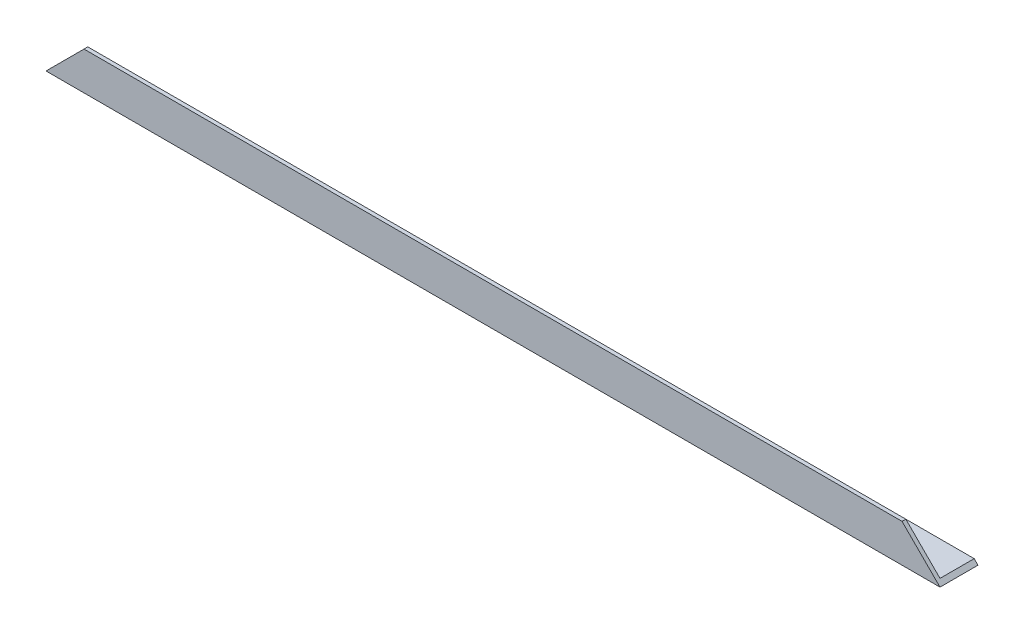
ISO-10303-21;
HEADER;
FILE_DESCRIPTION(('STEP AP214'),'2;1');
FILE_NAME('part.step','',(''),(''),'','','');
FILE_SCHEMA(('AUTOMOTIVE_DESIGN { 1 0 10303 214 1 1 1 1 }'));
ENDSEC;
DATA;
#1=APPLICATION_CONTEXT('core data for automotive mechanical design processes');
#2=APPLICATION_PROTOCOL_DEFINITION('international standard','automotive_design',2000,#1);
#3=PRODUCT_CONTEXT('',#1,'mechanical');
#4=PRODUCT('Part','Part','',(#3));
#5=PRODUCT_RELATED_PRODUCT_CATEGORY('part','',(#4));
#6=PRODUCT_DEFINITION_FORMATION('','',#4);
#7=PRODUCT_DEFINITION_CONTEXT('part definition',#1,'design');
#8=PRODUCT_DEFINITION('design','',#6,#7);
#9=PRODUCT_DEFINITION_SHAPE('','',#8);
#10=(LENGTH_UNIT() NAMED_UNIT(*) SI_UNIT(.MILLI.,.METRE.));
#11=(NAMED_UNIT(*) PLANE_ANGLE_UNIT() SI_UNIT($,.RADIAN.));
#12=(NAMED_UNIT(*) SI_UNIT($,.STERADIAN.) SOLID_ANGLE_UNIT());
#13=UNCERTAINTY_MEASURE_WITH_UNIT(LENGTH_MEASURE(1.E-05),#10,'distance_accuracy_value','');
#14=(GEOMETRIC_REPRESENTATION_CONTEXT(3) GLOBAL_UNCERTAINTY_ASSIGNED_CONTEXT((#13)) GLOBAL_UNIT_ASSIGNED_CONTEXT((#10,
#11,#12)) REPRESENTATION_CONTEXT('',''));
#15=CARTESIAN_POINT('',(0.,0.,0.));
#16=DIRECTION('',(0.,0.,1.));
#17=DIRECTION('',(1.,0.,0.));
#18=AXIS2_PLACEMENT_3D('',#15,#16,#17);
#19=CARTESIAN_POINT('',(353.,1.49999999999998,-15.));
#20=DIRECTION('',(0.,0.,1.));
#21=DIRECTION('',(1.,0.,0.));
#22=AXIS2_PLACEMENT_3D('',#19,#20,#21);
#23=PLANE('',#22);
#24=DIRECTION('',(-0.707106781186546,0.707106781186549,0.));
#25=VECTOR('',#24,1.);
#26=CARTESIAN_POINT('',(353.,0.,-15.));
#27=LINE('',#26,#25);
#28=CARTESIAN_POINT('',(353.,0.,-15.));
#29=VERTEX_POINT('',#28);
#30=CARTESIAN_POINT('',(351.5,1.49999999999998,-15.));
#31=VERTEX_POINT('',#30);
#32=EDGE_CURVE('E86',#29,#31,#27,.T.);
#33=ORIENTED_EDGE('',*,*,#32,.F.);
#34=DIRECTION('',(-1.,0.,0.));
#35=VECTOR('',#34,1.);
#36=CARTESIAN_POINT('',(353.,0.,-15.));
#37=LINE('',#36,#35);
#38=CARTESIAN_POINT('',(0.,0.,-15.));
#39=VERTEX_POINT('',#38);
#40=EDGE_CURVE('E11',#29,#39,#37,.T.);
#41=ORIENTED_EDGE('',*,*,#40,.T.);
#42=DIRECTION('',(0.707106781186546,0.707106781186549,0.));
#43=VECTOR('',#42,1.);
#44=CARTESIAN_POINT('',(0.,0.,-15.));
#45=LINE('',#44,#43);
#46=CARTESIAN_POINT('',(1.49999999999996,1.49999999999998,-15.));
#47=VERTEX_POINT('',#46);
#48=EDGE_CURVE('E122',#39,#47,#45,.T.);
#49=ORIENTED_EDGE('',*,*,#48,.T.);
#50=DIRECTION('',(-1.,0.,0.));
#51=VECTOR('',#50,1.);
#52=CARTESIAN_POINT('',(353.,1.49999999999998,-15.));
#53=LINE('',#52,#51);
#54=EDGE_CURVE('E45',#31,#47,#53,.T.);
#55=ORIENTED_EDGE('',*,*,#54,.F.);
#56=EDGE_LOOP('',(#33,#41,#49,#55));
#57=FACE_BOUND('',#56,.T.);
#58=ADVANCED_FACE('F36',(#57),#23,.F.);
#59=CARTESIAN_POINT('',(353.,1.5,-1.50000000000002));
#60=DIRECTION('',(0.,-1.,0.));
#61=DIRECTION('',(0.,0.,-1.));
#62=AXIS2_PLACEMENT_3D('',#59,#60,#61);
#63=PLANE('',#62);
#64=DIRECTION('',(0.,0.,1.));
#65=VECTOR('',#64,1.);
#66=CARTESIAN_POINT('',(351.5,1.5,-1.50000000000002));
#67=LINE('',#66,#65);
#68=CARTESIAN_POINT('',(351.5,1.5,-1.50000000000002));
#69=VERTEX_POINT('',#68);
#70=EDGE_CURVE('E119',#31,#69,#67,.T.);
#71=ORIENTED_EDGE('',*,*,#70,.F.);
#72=ORIENTED_EDGE('',*,*,#54,.T.);
#73=DIRECTION('',(0.,0.,1.));
#74=VECTOR('',#73,1.);
#75=CARTESIAN_POINT('',(1.5,1.5,-1.49999999999959));
#76=LINE('',#75,#74);
#77=CARTESIAN_POINT('',(1.49999999999997,1.5,-1.50000000000002));
#78=VERTEX_POINT('',#77);
#79=EDGE_CURVE('E103',#47,#78,#76,.T.);
#80=ORIENTED_EDGE('',*,*,#79,.T.);
#81=DIRECTION('',(-1.,0.,0.));
#82=VECTOR('',#81,1.);
#83=CARTESIAN_POINT('',(353.,1.5,-1.50000000000002));
#84=LINE('',#83,#82);
#85=EDGE_CURVE('E114',#69,#78,#84,.T.);
#86=ORIENTED_EDGE('',*,*,#85,.F.);
#87=EDGE_LOOP('',(#71,#72,#80,#86));
#88=FACE_BOUND('',#87,.T.);
#89=ADVANCED_FACE('F117',(#88),#63,.F.);
#90=CARTESIAN_POINT('',(353.,15.,-1.5));
#91=DIRECTION('',(0.,0.,1.));
#92=DIRECTION('',(0.,-1.,0.));
#93=AXIS2_PLACEMENT_3D('',#90,#91,#92);
#94=PLANE('',#93);
#95=DIRECTION('',(-0.707106781186546,0.707106781186549,0.));
#96=VECTOR('',#95,1.);
#97=CARTESIAN_POINT('',(345.5,7.50000000000002,-1.50000000000001));
#98=LINE('',#97,#96);
#99=CARTESIAN_POINT('',(338.,15.,-1.5));
#100=VERTEX_POINT('',#99);
#101=EDGE_CURVE('E138',#69,#100,#98,.T.);
#102=ORIENTED_EDGE('',*,*,#101,.F.);
#103=ORIENTED_EDGE('',*,*,#85,.T.);
#104=DIRECTION('',(0.707106781186546,0.707106781186549,0.));
#105=VECTOR('',#104,1.);
#106=CARTESIAN_POINT('',(183.999999999999,184.,-1.49999999999972));
#107=LINE('',#106,#105);
#108=CARTESIAN_POINT('',(14.9999999999999,15.,-1.5));
#109=VERTEX_POINT('',#108);
#110=EDGE_CURVE('E106',#78,#109,#107,.T.);
#111=ORIENTED_EDGE('',*,*,#110,.T.);
#112=DIRECTION('',(-1.,0.,0.));
#113=VECTOR('',#112,1.);
#114=CARTESIAN_POINT('',(353.,15.,-1.5));
#115=LINE('',#114,#113);
#116=EDGE_CURVE('E112',#100,#109,#115,.T.);
#117=ORIENTED_EDGE('',*,*,#116,.F.);
#118=EDGE_LOOP('',(#102,#103,#111,#117));
#119=FACE_BOUND('',#118,.T.);
#120=ADVANCED_FACE('F137',(#119),#94,.F.);
#121=CARTESIAN_POINT('',(353.,15.,0.));
#122=DIRECTION('',(0.,-1.,0.));
#123=DIRECTION('',(0.,0.,-1.));
#124=AXIS2_PLACEMENT_3D('',#121,#122,#123);
#125=PLANE('',#124);
#126=DIRECTION('',(0.,0.,1.));
#127=VECTOR('',#126,1.);
#128=CARTESIAN_POINT('',(338.,15.,0.));
#129=LINE('',#128,#127);
#130=CARTESIAN_POINT('',(338.,15.,0.));
#131=VERTEX_POINT('',#130);
#132=EDGE_CURVE('E98',#100,#131,#129,.T.);
#133=ORIENTED_EDGE('',*,*,#132,.F.);
#134=ORIENTED_EDGE('',*,*,#116,.T.);
#135=DIRECTION('',(0.,0.,1.));
#136=VECTOR('',#135,1.);
#137=CARTESIAN_POINT('',(14.9999999999999,15.,0.));
#138=LINE('',#137,#136);
#139=CARTESIAN_POINT('',(14.9999999999999,15.,0.));
#140=VERTEX_POINT('',#139);
#141=EDGE_CURVE('E125',#109,#140,#138,.T.);
#142=ORIENTED_EDGE('',*,*,#141,.T.);
#143=DIRECTION('',(-1.,0.,0.));
#144=VECTOR('',#143,1.);
#145=CARTESIAN_POINT('',(353.,15.,0.));
#146=LINE('',#145,#144);
#147=EDGE_CURVE('E110',#131,#140,#146,.T.);
#148=ORIENTED_EDGE('',*,*,#147,.F.);
#149=EDGE_LOOP('',(#133,#134,#142,#148));
#150=FACE_BOUND('',#149,.T.);
#151=ADVANCED_FACE('F146',(#150),#125,.F.);
#152=CARTESIAN_POINT('',(353.,0.,0.));
#153=DIRECTION('',(0.,0.,-1.));
#154=DIRECTION('',(-1.,0.,0.));
#155=AXIS2_PLACEMENT_3D('',#152,#153,#154);
#156=PLANE('',#155);
#157=DIRECTION('',(-0.707106781186546,0.707106781186549,0.));
#158=VECTOR('',#157,1.);
#159=CARTESIAN_POINT('',(353.,0.,0.));
#160=LINE('',#159,#158);
#161=CARTESIAN_POINT('',(353.,0.,0.));
#162=VERTEX_POINT('',#161);
#163=EDGE_CURVE('E51',#162,#131,#160,.T.);
#164=ORIENTED_EDGE('',*,*,#163,.T.);
#165=ORIENTED_EDGE('',*,*,#147,.T.);
#166=DIRECTION('',(0.707106781186546,0.707106781186549,0.));
#167=VECTOR('',#166,1.);
#168=CARTESIAN_POINT('',(0.,0.,0.));
#169=LINE('',#168,#167);
#170=CARTESIAN_POINT('',(0.,0.,0.));
#171=VERTEX_POINT('',#170);
#172=EDGE_CURVE('E126',#171,#140,#169,.T.);
#173=ORIENTED_EDGE('',*,*,#172,.F.);
#174=DIRECTION('',(-1.,0.,0.));
#175=VECTOR('',#174,1.);
#176=CARTESIAN_POINT('',(353.,0.,0.));
#177=LINE('',#176,#175);
#178=EDGE_CURVE('E91',#162,#171,#177,.T.);
#179=ORIENTED_EDGE('',*,*,#178,.F.);
#180=EDGE_LOOP('',(#164,#165,#173,#179));
#181=FACE_BOUND('',#180,.T.);
#182=ADVANCED_FACE('F144',(#181),#156,.F.);
#183=CARTESIAN_POINT('',(353.,0.,-15.));
#184=DIRECTION('',(0.,1.,0.));
#185=DIRECTION('',(0.,0.,1.));
#186=AXIS2_PLACEMENT_3D('',#183,#184,#185);
#187=PLANE('',#186);
#188=DIRECTION('',(0.,0.,-1.));
#189=VECTOR('',#188,1.);
#190=CARTESIAN_POINT('',(0.,0.,-15.));
#191=LINE('',#190,#189);
#192=EDGE_CURVE('E92',#171,#39,#191,.T.);
#193=ORIENTED_EDGE('',*,*,#192,.T.);
#194=ORIENTED_EDGE('',*,*,#40,.F.);
#195=DIRECTION('',(0.,0.,-1.));
#196=VECTOR('',#195,1.);
#197=CARTESIAN_POINT('',(353.,0.,-15.));
#198=LINE('',#197,#196);
#199=EDGE_CURVE('E83',#162,#29,#198,.T.);
#200=ORIENTED_EDGE('',*,*,#199,.F.);
#201=ORIENTED_EDGE('',*,*,#178,.T.);
#202=EDGE_LOOP('',(#193,#194,#200,#201));
#203=FACE_BOUND('',#202,.T.);
#204=ADVANCED_FACE('F38',(#203),#187,.F.);
#205=CARTESIAN_POINT('',(0.,0.,-15.));
#206=DIRECTION('',(0.707106781186549,-0.707106781186546,0.));
#207=DIRECTION('',(0.707106781186546,0.707106781186549,0.));
#208=AXIS2_PLACEMENT_3D('',#205,#206,#207);
#209=PLANE('',#208);
#210=ORIENTED_EDGE('',*,*,#48,.F.);
#211=ORIENTED_EDGE('',*,*,#192,.F.);
#212=ORIENTED_EDGE('',*,*,#172,.T.);
#213=ORIENTED_EDGE('',*,*,#141,.F.);
#214=ORIENTED_EDGE('',*,*,#110,.F.);
#215=ORIENTED_EDGE('',*,*,#79,.F.);
#216=EDGE_LOOP('',(#210,#211,#212,#213,#214,#215));
#217=FACE_BOUND('',#216,.T.);
#218=ADVANCED_FACE('F121',(#217),#209,.F.);
#219=CARTESIAN_POINT('',(353.,0.,-15.));
#220=DIRECTION('',(0.707106781186549,0.707106781186546,0.));
#221=DIRECTION('',(-0.707106781186546,0.707106781186549,0.));
#222=AXIS2_PLACEMENT_3D('',#219,#220,#221);
#223=PLANE('',#222);
#224=ORIENTED_EDGE('',*,*,#70,.T.);
#225=ORIENTED_EDGE('',*,*,#101,.T.);
#226=ORIENTED_EDGE('',*,*,#132,.T.);
#227=ORIENTED_EDGE('',*,*,#163,.F.);
#228=ORIENTED_EDGE('',*,*,#199,.T.);
#229=ORIENTED_EDGE('',*,*,#32,.T.);
#230=EDGE_LOOP('',(#224,#225,#226,#227,#228,#229));
#231=FACE_BOUND('',#230,.T.);
#232=ADVANCED_FACE('F85',(#231),#223,.T.);
#233=CLOSED_SHELL('',(#58,#89,#120,#151,#182,#204,#218,#232));
#234=MANIFOLD_SOLID_BREP('B2',#233);
#235=ADVANCED_BREP_SHAPE_REPRESENTATION('',(#18,#234),#14);
#236=SHAPE_DEFINITION_REPRESENTATION(#9,#235);
ENDSEC;
END-ISO-10303-21;
